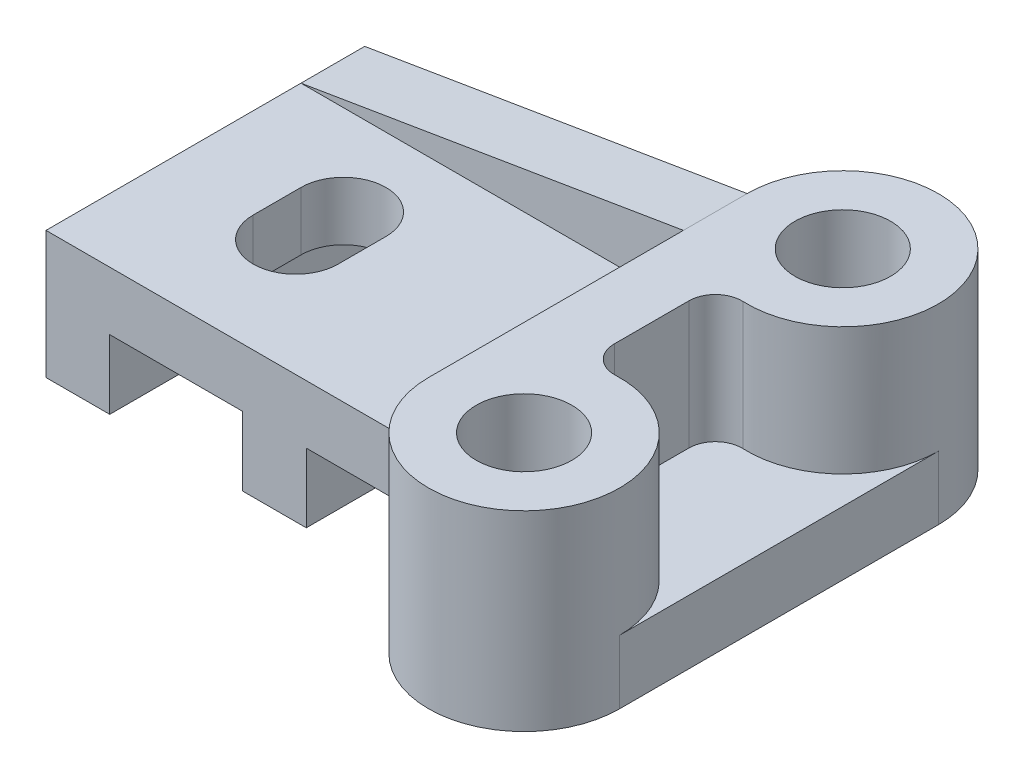
ISO-10303-21;
HEADER;
FILE_DESCRIPTION(('STEP AP214'),'2;1');
FILE_NAME('part.step','',(''),(''),'','','');
FILE_SCHEMA(('AUTOMOTIVE_DESIGN { 1 0 10303 214 1 1 1 1 }'));
ENDSEC;
DATA;
#1=APPLICATION_CONTEXT('core data for automotive mechanical design processes');
#2=APPLICATION_PROTOCOL_DEFINITION('international standard','automotive_design',2000,#1);
#3=PRODUCT_CONTEXT('',#1,'mechanical');
#4=PRODUCT('Part','Part','',(#3));
#5=PRODUCT_RELATED_PRODUCT_CATEGORY('part','',(#4));
#6=PRODUCT_DEFINITION_FORMATION('','',#4);
#7=PRODUCT_DEFINITION_CONTEXT('part definition',#1,'design');
#8=PRODUCT_DEFINITION('design','',#6,#7);
#9=PRODUCT_DEFINITION_SHAPE('','',#8);
#10=(LENGTH_UNIT() NAMED_UNIT(*) SI_UNIT(.MILLI.,.METRE.));
#11=(NAMED_UNIT(*) PLANE_ANGLE_UNIT() SI_UNIT($,.RADIAN.));
#12=(NAMED_UNIT(*) SI_UNIT($,.STERADIAN.) SOLID_ANGLE_UNIT());
#13=UNCERTAINTY_MEASURE_WITH_UNIT(LENGTH_MEASURE(1.E-05),#10,'distance_accuracy_value','');
#14=(GEOMETRIC_REPRESENTATION_CONTEXT(3) GLOBAL_UNCERTAINTY_ASSIGNED_CONTEXT((#13)) GLOBAL_UNIT_ASSIGNED_CONTEXT((#10,
#11,#12)) REPRESENTATION_CONTEXT('',''));
#15=CARTESIAN_POINT('',(0.,0.,0.));
#16=DIRECTION('',(0.,0.,1.));
#17=DIRECTION('',(1.,0.,0.));
#18=AXIS2_PLACEMENT_3D('',#15,#16,#17);
#19=CARTESIAN_POINT('',(0.,24.,30.));
#20=DIRECTION('',(0.,-1.,0.));
#21=DIRECTION('',(0.,0.,-1.));
#22=AXIS2_PLACEMENT_3D('',#19,#20,#21);
#23=PLANE('',#22);
#24=DIRECTION('',(0.,0.,1.));
#25=VECTOR('',#24,1.);
#26=CARTESIAN_POINT('',(17.,24.,-0.999999999999998));
#27=LINE('',#26,#25);
#28=CARTESIAN_POINT('',(17.,24.,-0.999999999999997));
#29=VERTEX_POINT('',#28);
#30=CARTESIAN_POINT('',(17.,24.,8.));
#31=VERTEX_POINT('',#30);
#32=EDGE_CURVE('E203',#29,#31,#27,.T.);
#33=ORIENTED_EDGE('',*,*,#32,.F.);
#34=CARTESIAN_POINT('',(25.,24.,-0.999999999999999));
#35=DIRECTION('',(0.,1.,0.));
#36=DIRECTION('',(0.,0.,1.));
#37=AXIS2_PLACEMENT_3D('',#34,#35,#36);
#38=CIRCLE('',#37,8.);
#39=CARTESIAN_POINT('',(33.,24.,-1.));
#40=VERTEX_POINT('',#39);
#41=EDGE_CURVE('E51',#40,#29,#38,.T.);
#42=ORIENTED_EDGE('',*,*,#41,.F.);
#43=DIRECTION('',(0.,0.,-1.));
#44=VECTOR('',#43,1.);
#45=CARTESIAN_POINT('',(33.,24.,-1.));
#46=LINE('',#45,#44);
#47=CARTESIAN_POINT('',(33.,24.,8.));
#48=VERTEX_POINT('',#47);
#49=EDGE_CURVE('E209',#48,#40,#46,.T.);
#50=ORIENTED_EDGE('',*,*,#49,.F.);
#51=CARTESIAN_POINT('',(25.,24.,8.));
#52=DIRECTION('',(0.,1.,0.));
#53=DIRECTION('',(0.,0.,1.));
#54=AXIS2_PLACEMENT_3D('',#51,#52,#53);
#55=CIRCLE('',#54,8.);
#56=EDGE_CURVE('E194',#31,#48,#55,.T.);
#57=ORIENTED_EDGE('',*,*,#56,.F.);
#58=EDGE_LOOP('',(#33,#42,#50,#57));
#59=FACE_BOUND('',#58,.T.);
#60=DIRECTION('',(1.,0.,0.));
#61=VECTOR('',#60,1.);
#62=CARTESIAN_POINT('',(0.,24.,-18.));
#63=LINE('',#62,#61);
#64=CARTESIAN_POINT('',(0.,24.,-18.));
#65=VERTEX_POINT('',#64);
#66=CARTESIAN_POINT('',(72.,24.,-18.));
#67=VERTEX_POINT('',#66);
#68=EDGE_CURVE('E226',#65,#67,#63,.T.);
#69=ORIENTED_EDGE('',*,*,#68,.F.);
#70=DIRECTION('',(0.,0.,-1.));
#71=VECTOR('',#70,1.);
#72=CARTESIAN_POINT('',(0.,24.,30.));
#73=LINE('',#72,#71);
#74=CARTESIAN_POINT('',(0.,24.,30.));
#75=VERTEX_POINT('',#74);
#76=EDGE_CURVE('E342',#75,#65,#73,.T.);
#77=ORIENTED_EDGE('',*,*,#76,.F.);
#78=DIRECTION('',(-1.,0.,0.));
#79=VECTOR('',#78,1.);
#80=CARTESIAN_POINT('',(0.,24.,30.));
#81=LINE('',#80,#79);
#82=CARTESIAN_POINT('',(72.,24.,30.));
#83=VERTEX_POINT('',#82);
#84=EDGE_CURVE('E312',#83,#75,#81,.T.);
#85=ORIENTED_EDGE('',*,*,#84,.F.);
#86=DIRECTION('',(0.,0.,-1.));
#87=VECTOR('',#86,1.);
#88=CARTESIAN_POINT('',(72.,24.,30.));
#89=LINE('',#88,#87);
#90=EDGE_CURVE('E345',#83,#67,#89,.T.);
#91=ORIENTED_EDGE('',*,*,#90,.T.);
#92=EDGE_LOOP('',(#69,#77,#85,#91));
#93=FACE_BOUND('',#92,.T.);
#94=ADVANCED_FACE('F36',(#59,#93),#23,.F.);
#95=CARTESIAN_POINT('',(72.,0.,-30.));
#96=DIRECTION('',(-1.,0.,0.));
#97=DIRECTION('',(0.,0.,1.));
#98=AXIS2_PLACEMENT_3D('',#95,#96,#97);
#99=PLANE('',#98);
#100=DIRECTION('',(0.,0.,1.));
#101=VECTOR('',#100,1.);
#102=CARTESIAN_POINT('',(72.,36.,-30.));
#103=LINE('',#102,#101);
#104=CARTESIAN_POINT('',(72.,36.,-18.));
#105=VERTEX_POINT('',#104);
#106=CARTESIAN_POINT('',(72.,36.,30.));
#107=VERTEX_POINT('',#106);
#108=EDGE_CURVE('E263',#105,#107,#103,.T.);
#109=ORIENTED_EDGE('',*,*,#108,.F.);
#110=DIRECTION('',(0.,-1.,0.));
#111=VECTOR('',#110,1.);
#112=CARTESIAN_POINT('',(72.,0.,-18.));
#113=LINE('',#112,#111);
#114=EDGE_CURVE('E221',#105,#67,#113,.T.);
#115=ORIENTED_EDGE('',*,*,#114,.T.);
#116=ORIENTED_EDGE('',*,*,#90,.F.);
#117=DIRECTION('',(0.,1.,0.));
#118=VECTOR('',#117,1.);
#119=CARTESIAN_POINT('',(72.,0.,30.));
#120=LINE('',#119,#118);
#121=EDGE_CURVE('E291',#83,#107,#120,.T.);
#122=ORIENTED_EDGE('',*,*,#121,.T.);
#123=EDGE_LOOP('',(#109,#115,#116,#122));
#124=FACE_BOUND('',#123,.T.);
#125=ADVANCED_FACE('F399',(#124),#99,.T.);
#126=CARTESIAN_POINT('',(90.,0.,-30.));
#127=DIRECTION('',(0.,1.,0.));
#128=DIRECTION('',(0.,0.,1.));
#129=AXIS2_PLACEMENT_3D('',#126,#127,#128);
#130=CYLINDRICAL_SURFACE('',#129,18.);
#131=DIRECTION('',(0.,1.,0.));
#132=VECTOR('',#131,1.);
#133=CARTESIAN_POINT('',(72.,13.,-30.));
#134=LINE('',#133,#132);
#135=CARTESIAN_POINT('',(72.,13.,-30.));
#136=VERTEX_POINT('',#135);
#137=CARTESIAN_POINT('',(72.,36.,-30.));
#138=VERTEX_POINT('',#137);
#139=EDGE_CURVE('E337',#136,#138,#134,.T.);
#140=ORIENTED_EDGE('',*,*,#139,.T.);
#141=CARTESIAN_POINT('',(90.,36.,-30.));
#142=DIRECTION('',(0.,1.,0.));
#143=DIRECTION('',(0.,0.,1.));
#144=AXIS2_PLACEMENT_3D('',#141,#142,#143);
#145=CIRCLE('',#144,18.);
#146=CARTESIAN_POINT('',(89.2173913043478,36.,-12.0170212804027));
#147=VERTEX_POINT('',#146);
#148=EDGE_CURVE('E260',#147,#138,#145,.T.);
#149=ORIENTED_EDGE('',*,*,#148,.F.);
#150=DIRECTION('',(0.,1.,0.));
#151=VECTOR('',#150,1.);
#152=CARTESIAN_POINT('',(89.2173913043478,0.,-12.0170212804027));
#153=LINE('',#152,#151);
#154=CARTESIAN_POINT('',(89.2173913043478,12.,-12.0170212804027));
#155=VERTEX_POINT('',#154);
#156=EDGE_CURVE('E369',#147,#155,#153,.F.);
#157=ORIENTED_EDGE('',*,*,#156,.T.);
#158=CARTESIAN_POINT('',(90.,12.,-30.));
#159=DIRECTION('',(0.,1.,0.));
#160=DIRECTION('',(0.,0.,-1.));
#161=AXIS2_PLACEMENT_3D('',#158,#159,#160);
#162=CIRCLE('',#161,18.);
#163=CARTESIAN_POINT('',(108.,12.,-30.));
#164=VERTEX_POINT('',#163);
#165=EDGE_CURVE('E243',#155,#164,#162,.T.);
#166=ORIENTED_EDGE('',*,*,#165,.T.);
#167=DIRECTION('',(0.,-1.,0.));
#168=VECTOR('',#167,1.);
#169=CARTESIAN_POINT('',(108.,12.,-30.));
#170=LINE('',#169,#168);
#171=CARTESIAN_POINT('',(108.,0.,-30.));
#172=VERTEX_POINT('',#171);
#173=EDGE_CURVE('E247',#164,#172,#170,.T.);
#174=ORIENTED_EDGE('',*,*,#173,.T.);
#175=CARTESIAN_POINT('',(90.,0.,-30.));
#176=DIRECTION('',(0.,1.,0.));
#177=DIRECTION('',(0.,0.,1.));
#178=AXIS2_PLACEMENT_3D('',#175,#176,#177);
#179=CIRCLE('',#178,18.);
#180=CARTESIAN_POINT('',(72.,0.,-30.));
#181=VERTEX_POINT('',#180);
#182=EDGE_CURVE('E279',#172,#181,#179,.T.);
#183=ORIENTED_EDGE('',*,*,#182,.T.);
#184=DIRECTION('',(0.,1.,0.));
#185=VECTOR('',#184,1.);
#186=CARTESIAN_POINT('',(72.,0.,-30.));
#187=LINE('',#186,#185);
#188=EDGE_CURVE('E286',#181,#136,#187,.T.);
#189=ORIENTED_EDGE('',*,*,#188,.T.);
#190=EDGE_LOOP('',(#140,#149,#157,#166,#174,#183,#189));
#191=FACE_BOUND('',#190,.T.);
#192=ADVANCED_FACE('F404',(#191),#130,.T.);
#193=CARTESIAN_POINT('',(84.,0.,-13.0294372515229));
#194=DIRECTION('',(1.,0.,0.));
#195=DIRECTION('',(0.,0.,-1.));
#196=AXIS2_PLACEMENT_3D('',#193,#194,#195);
#197=PLANE('',#196);
#198=DIRECTION('',(0.,-1.,0.));
#199=VECTOR('',#198,1.);
#200=CARTESIAN_POINT('',(84.,0.,7.02174941384788));
#201=LINE('',#200,#199);
#202=CARTESIAN_POINT('',(84.,36.,7.02174941384788));
#203=VERTEX_POINT('',#202);
#204=CARTESIAN_POINT('',(84.,12.,7.02174941384788));
#205=VERTEX_POINT('',#204);
#206=EDGE_CURVE('E366',#203,#205,#201,.T.);
#207=ORIENTED_EDGE('',*,*,#206,.T.);
#208=DIRECTION('',(0.,0.,-1.));
#209=VECTOR('',#208,1.);
#210=CARTESIAN_POINT('',(84.,12.,7.02174941384788));
#211=LINE('',#210,#209);
#212=CARTESIAN_POINT('',(84.,12.,-7.02174941384788));
#213=VERTEX_POINT('',#212);
#214=EDGE_CURVE('E237',#205,#213,#211,.T.);
#215=ORIENTED_EDGE('',*,*,#214,.T.);
#216=DIRECTION('',(0.,-1.,0.));
#217=VECTOR('',#216,1.);
#218=CARTESIAN_POINT('',(84.,36.,-7.02174941384788));
#219=LINE('',#218,#217);
#220=CARTESIAN_POINT('',(84.,36.,-7.02174941384788));
#221=VERTEX_POINT('',#220);
#222=EDGE_CURVE('E364',#213,#221,#219,.F.);
#223=ORIENTED_EDGE('',*,*,#222,.T.);
#224=DIRECTION('',(0.,0.,-1.));
#225=VECTOR('',#224,1.);
#226=CARTESIAN_POINT('',(84.,36.,-13.0294372515229));
#227=LINE('',#226,#225);
#228=EDGE_CURVE('E270',#203,#221,#227,.T.);
#229=ORIENTED_EDGE('',*,*,#228,.F.);
#230=EDGE_LOOP('',(#207,#215,#223,#229));
#231=FACE_BOUND('',#230,.T.);
#232=ADVANCED_FACE('F439',(#231),#197,.T.);
#233=CARTESIAN_POINT('',(89.,0.,7.02174941384788));
#234=DIRECTION('',(0.,1.,0.));
#235=DIRECTION('',(0.,0.,1.));
#236=AXIS2_PLACEMENT_3D('',#233,#234,#235);
#237=CYLINDRICAL_SURFACE('',#236,5.);
#238=CARTESIAN_POINT('',(89.,12.,7.02174941384788));
#239=DIRECTION('',(0.,-1.,0.));
#240=DIRECTION('',(0.,0.,-1.));
#241=AXIS2_PLACEMENT_3D('',#238,#239,#240);
#242=CIRCLE('',#241,5.);
#243=CARTESIAN_POINT('',(89.2173913043478,12.,12.0170212804027));
#244=VERTEX_POINT('',#243);
#245=EDGE_CURVE('E234',#244,#205,#242,.T.);
#246=ORIENTED_EDGE('',*,*,#245,.T.);
#247=ORIENTED_EDGE('',*,*,#206,.F.);
#248=CARTESIAN_POINT('',(89.,36.,7.02174941384788));
#249=DIRECTION('',(0.,1.,0.));
#250=DIRECTION('',(0.,0.,1.));
#251=AXIS2_PLACEMENT_3D('',#248,#249,#250);
#252=CIRCLE('',#251,5.);
#253=CARTESIAN_POINT('',(89.2173913043478,36.,12.0170212804027));
#254=VERTEX_POINT('',#253);
#255=EDGE_CURVE('E372',#254,#203,#252,.F.);
#256=ORIENTED_EDGE('',*,*,#255,.F.);
#257=DIRECTION('',(0.,1.,0.));
#258=VECTOR('',#257,1.);
#259=CARTESIAN_POINT('',(89.2173913043478,0.,12.0170212804027));
#260=LINE('',#259,#258);
#261=EDGE_CURVE('E362',#244,#254,#260,.T.);
#262=ORIENTED_EDGE('',*,*,#261,.F.);
#263=EDGE_LOOP('',(#246,#247,#256,#262));
#264=FACE_BOUND('',#263,.T.);
#265=ADVANCED_FACE('F437',(#264),#237,.F.);
#266=CARTESIAN_POINT('',(89.,0.,-7.02174941384788));
#267=DIRECTION('',(0.,1.,0.));
#268=DIRECTION('',(0.,0.,1.));
#269=AXIS2_PLACEMENT_3D('',#266,#267,#268);
#270=CYLINDRICAL_SURFACE('',#269,5.);
#271=CARTESIAN_POINT('',(89.,12.,-7.02174941384788));
#272=DIRECTION('',(0.,-1.,0.));
#273=DIRECTION('',(0.,0.,-1.));
#274=AXIS2_PLACEMENT_3D('',#271,#272,#273);
#275=CIRCLE('',#274,5.);
#276=EDGE_CURVE('E240',#213,#155,#275,.T.);
#277=ORIENTED_EDGE('',*,*,#276,.T.);
#278=ORIENTED_EDGE('',*,*,#156,.F.);
#279=CARTESIAN_POINT('',(89.,36.,-7.02174941384788));
#280=DIRECTION('',(0.,1.,0.));
#281=DIRECTION('',(0.,0.,1.));
#282=AXIS2_PLACEMENT_3D('',#279,#280,#281);
#283=CIRCLE('',#282,5.);
#284=EDGE_CURVE('E374',#221,#147,#283,.F.);
#285=ORIENTED_EDGE('',*,*,#284,.F.);
#286=ORIENTED_EDGE('',*,*,#222,.F.);
#287=EDGE_LOOP('',(#277,#278,#285,#286));
#288=FACE_BOUND('',#287,.T.);
#289=ADVANCED_FACE('F38',(#288),#270,.F.);
#290=CARTESIAN_POINT('',(0.,0.,30.));
#291=DIRECTION('',(0.,1.,0.));
#292=DIRECTION('',(0.,0.,1.));
#293=AXIS2_PLACEMENT_3D('',#290,#291,#292);
#294=PLANE('',#293);
#295=DIRECTION('',(1.,0.,0.));
#296=VECTOR('',#295,1.);
#297=CARTESIAN_POINT('',(0.,0.,-30.));
#298=LINE('',#297,#296);
#299=CARTESIAN_POINT('',(0.,0.,-30.));
#300=VERTEX_POINT('',#299);
#301=CARTESIAN_POINT('',(12.,0.,-30.));
#302=VERTEX_POINT('',#301);
#303=EDGE_CURVE('E290',#300,#302,#298,.T.);
#304=ORIENTED_EDGE('',*,*,#303,.T.);
#305=DIRECTION('',(0.,0.,-1.));
#306=VECTOR('',#305,1.);
#307=CARTESIAN_POINT('',(12.,0.,30.));
#308=LINE('',#307,#306);
#309=CARTESIAN_POINT('',(12.,0.,30.));
#310=VERTEX_POINT('',#309);
#311=EDGE_CURVE('E360',#310,#302,#308,.T.);
#312=ORIENTED_EDGE('',*,*,#311,.F.);
#313=DIRECTION('',(1.,0.,0.));
#314=VECTOR('',#313,1.);
#315=CARTESIAN_POINT('',(0.,0.,30.));
#316=LINE('',#315,#314);
#317=CARTESIAN_POINT('',(0.,0.,30.));
#318=VERTEX_POINT('',#317);
#319=EDGE_CURVE('E294',#318,#310,#316,.T.);
#320=ORIENTED_EDGE('',*,*,#319,.F.);
#321=DIRECTION('',(0.,0.,-1.));
#322=VECTOR('',#321,1.);
#323=CARTESIAN_POINT('',(0.,0.,30.));
#324=LINE('',#323,#322);
#325=EDGE_CURVE('E316',#318,#300,#324,.T.);
#326=ORIENTED_EDGE('',*,*,#325,.T.);
#327=EDGE_LOOP('',(#304,#312,#320,#326));
#328=FACE_BOUND('',#327,.T.);
#329=ADVANCED_FACE('F433',(#328),#294,.F.);
#330=CARTESIAN_POINT('',(12.,0.,30.));
#331=DIRECTION('',(-1.,0.,0.));
#332=DIRECTION('',(0.,0.,1.));
#333=AXIS2_PLACEMENT_3D('',#330,#331,#332);
#334=PLANE('',#333);
#335=DIRECTION('',(0.,1.,0.));
#336=VECTOR('',#335,1.);
#337=CARTESIAN_POINT('',(12.,0.,-30.));
#338=LINE('',#337,#336);
#339=CARTESIAN_POINT('',(12.,13.,-30.));
#340=VERTEX_POINT('',#339);
#341=EDGE_CURVE('E319',#302,#340,#338,.T.);
#342=ORIENTED_EDGE('',*,*,#341,.T.);
#343=DIRECTION('',(0.,0.,-1.));
#344=VECTOR('',#343,1.);
#345=CARTESIAN_POINT('',(12.,13.,30.));
#346=LINE('',#345,#344);
#347=CARTESIAN_POINT('',(12.,13.,30.));
#348=VERTEX_POINT('',#347);
#349=EDGE_CURVE('E358',#348,#340,#346,.T.);
#350=ORIENTED_EDGE('',*,*,#349,.F.);
#351=DIRECTION('',(0.,1.,0.));
#352=VECTOR('',#351,1.);
#353=CARTESIAN_POINT('',(12.,0.,30.));
#354=LINE('',#353,#352);
#355=EDGE_CURVE('E297',#310,#348,#354,.T.);
#356=ORIENTED_EDGE('',*,*,#355,.F.);
#357=ORIENTED_EDGE('',*,*,#311,.T.);
#358=EDGE_LOOP('',(#342,#350,#356,#357));
#359=FACE_BOUND('',#358,.T.);
#360=ADVANCED_FACE('F430',(#359),#334,.F.);
#361=CARTESIAN_POINT('',(12.,13.,30.));
#362=DIRECTION('',(0.,1.,0.));
#363=DIRECTION('',(0.,0.,1.));
#364=AXIS2_PLACEMENT_3D('',#361,#362,#363);
#365=PLANE('',#364);
#366=DIRECTION('',(0.,0.,-1.));
#367=VECTOR('',#366,1.);
#368=CARTESIAN_POINT('',(33.,13.,30.));
#369=LINE('',#368,#367);
#370=CARTESIAN_POINT('',(33.,13.,8.));
#371=VERTEX_POINT('',#370);
#372=CARTESIAN_POINT('',(33.,13.,-1.));
#373=VERTEX_POINT('',#372);
#374=EDGE_CURVE('E44',#371,#373,#369,.T.);
#375=ORIENTED_EDGE('',*,*,#374,.T.);
#376=CARTESIAN_POINT('',(25.,13.,-0.999999999999999));
#377=DIRECTION('',(0.,1.,0.));
#378=DIRECTION('',(0.,0.,1.));
#379=AXIS2_PLACEMENT_3D('',#376,#377,#378);
#380=CIRCLE('',#379,8.);
#381=CARTESIAN_POINT('',(17.,13.,-0.999999999999998));
#382=VERTEX_POINT('',#381);
#383=EDGE_CURVE('E11',#373,#382,#380,.T.);
#384=ORIENTED_EDGE('',*,*,#383,.T.);
#385=DIRECTION('',(0.,0.,1.));
#386=VECTOR('',#385,1.);
#387=CARTESIAN_POINT('',(17.,13.,30.));
#388=LINE('',#387,#386);
#389=CARTESIAN_POINT('',(17.,13.,8.));
#390=VERTEX_POINT('',#389);
#391=EDGE_CURVE('E376',#382,#390,#388,.T.);
#392=ORIENTED_EDGE('',*,*,#391,.T.);
#393=CARTESIAN_POINT('',(25.,13.,8.));
#394=DIRECTION('',(0.,1.,0.));
#395=DIRECTION('',(0.,0.,1.));
#396=AXIS2_PLACEMENT_3D('',#393,#394,#395);
#397=CIRCLE('',#396,8.);
#398=EDGE_CURVE('E197',#390,#371,#397,.T.);
#399=ORIENTED_EDGE('',*,*,#398,.T.);
#400=EDGE_LOOP('',(#375,#384,#392,#399));
#401=FACE_BOUND('',#400,.T.);
#402=DIRECTION('',(1.,0.,0.));
#403=VECTOR('',#402,1.);
#404=CARTESIAN_POINT('',(12.,13.,-30.));
#405=LINE('',#404,#403);
#406=CARTESIAN_POINT('',(37.,13.,-30.));
#407=VERTEX_POINT('',#406);
#408=EDGE_CURVE('E322',#340,#407,#405,.T.);
#409=ORIENTED_EDGE('',*,*,#408,.T.);
#410=DIRECTION('',(0.,0.,-1.));
#411=VECTOR('',#410,1.);
#412=CARTESIAN_POINT('',(37.,13.,30.));
#413=LINE('',#412,#411);
#414=CARTESIAN_POINT('',(37.,13.,30.));
#415=VERTEX_POINT('',#414);
#416=EDGE_CURVE('E356',#415,#407,#413,.T.);
#417=ORIENTED_EDGE('',*,*,#416,.F.);
#418=DIRECTION('',(1.,0.,0.));
#419=VECTOR('',#418,1.);
#420=CARTESIAN_POINT('',(12.,13.,30.));
#421=LINE('',#420,#419);
#422=EDGE_CURVE('E300',#348,#415,#421,.T.);
#423=ORIENTED_EDGE('',*,*,#422,.F.);
#424=ORIENTED_EDGE('',*,*,#349,.T.);
#425=EDGE_LOOP('',(#409,#417,#423,#424));
#426=FACE_BOUND('',#425,.T.);
#427=ADVANCED_FACE('F380',(#401,#426),#365,.F.);
#428=CARTESIAN_POINT('',(37.,13.,30.));
#429=DIRECTION('',(1.,0.,0.));
#430=DIRECTION('',(0.,0.,-1.));
#431=AXIS2_PLACEMENT_3D('',#428,#429,#430);
#432=PLANE('',#431);
#433=DIRECTION('',(0.,-1.,0.));
#434=VECTOR('',#433,1.);
#435=CARTESIAN_POINT('',(37.,13.,-30.));
#436=LINE('',#435,#434);
#437=CARTESIAN_POINT('',(37.,0.,-30.));
#438=VERTEX_POINT('',#437);
#439=EDGE_CURVE('E325',#407,#438,#436,.T.);
#440=ORIENTED_EDGE('',*,*,#439,.T.);
#441=DIRECTION('',(0.,0.,-1.));
#442=VECTOR('',#441,1.);
#443=CARTESIAN_POINT('',(37.,0.,30.));
#444=LINE('',#443,#442);
#445=CARTESIAN_POINT('',(37.,0.,30.));
#446=VERTEX_POINT('',#445);
#447=EDGE_CURVE('E354',#446,#438,#444,.T.);
#448=ORIENTED_EDGE('',*,*,#447,.F.);
#449=DIRECTION('',(0.,-1.,0.));
#450=VECTOR('',#449,1.);
#451=CARTESIAN_POINT('',(37.,13.,30.));
#452=LINE('',#451,#450);
#453=EDGE_CURVE('E302',#415,#446,#452,.T.);
#454=ORIENTED_EDGE('',*,*,#453,.F.);
#455=ORIENTED_EDGE('',*,*,#416,.T.);
#456=EDGE_LOOP('',(#440,#448,#454,#455));
#457=FACE_BOUND('',#456,.T.);
#458=ADVANCED_FACE('F423',(#457),#432,.F.);
#459=CARTESIAN_POINT('',(37.,0.,30.));
#460=DIRECTION('',(0.,1.,0.));
#461=DIRECTION('',(0.,0.,1.));
#462=AXIS2_PLACEMENT_3D('',#459,#460,#461);
#463=PLANE('',#462);
#464=DIRECTION('',(1.,0.,0.));
#465=VECTOR('',#464,1.);
#466=CARTESIAN_POINT('',(37.,0.,-30.));
#467=LINE('',#466,#465);
#468=CARTESIAN_POINT('',(49.,0.,-30.));
#469=VERTEX_POINT('',#468);
#470=EDGE_CURVE('E328',#438,#469,#467,.T.);
#471=ORIENTED_EDGE('',*,*,#470,.T.);
#472=DIRECTION('',(0.,0.,-1.));
#473=VECTOR('',#472,1.);
#474=CARTESIAN_POINT('',(49.,0.,30.));
#475=LINE('',#474,#473);
#476=CARTESIAN_POINT('',(49.,0.,30.));
#477=VERTEX_POINT('',#476);
#478=EDGE_CURVE('E352',#477,#469,#475,.T.);
#479=ORIENTED_EDGE('',*,*,#478,.F.);
#480=DIRECTION('',(1.,0.,0.));
#481=VECTOR('',#480,1.);
#482=CARTESIAN_POINT('',(37.,0.,30.));
#483=LINE('',#482,#481);
#484=EDGE_CURVE('E304',#446,#477,#483,.T.);
#485=ORIENTED_EDGE('',*,*,#484,.F.);
#486=ORIENTED_EDGE('',*,*,#447,.T.);
#487=EDGE_LOOP('',(#471,#479,#485,#486));
#488=FACE_BOUND('',#487,.T.);
#489=ADVANCED_FACE('F419',(#488),#463,.F.);
#490=CARTESIAN_POINT('',(49.,0.,30.));
#491=DIRECTION('',(-1.,0.,0.));
#492=DIRECTION('',(0.,0.,1.));
#493=AXIS2_PLACEMENT_3D('',#490,#491,#492);
#494=PLANE('',#493);
#495=DIRECTION('',(0.,1.,0.));
#496=VECTOR('',#495,1.);
#497=CARTESIAN_POINT('',(49.,0.,-30.));
#498=LINE('',#497,#496);
#499=CARTESIAN_POINT('',(49.,13.,-30.));
#500=VERTEX_POINT('',#499);
#501=EDGE_CURVE('E331',#469,#500,#498,.T.);
#502=ORIENTED_EDGE('',*,*,#501,.T.);
#503=DIRECTION('',(0.,0.,-1.));
#504=VECTOR('',#503,1.);
#505=CARTESIAN_POINT('',(49.,13.,30.));
#506=LINE('',#505,#504);
#507=CARTESIAN_POINT('',(49.,13.,30.));
#508=VERTEX_POINT('',#507);
#509=EDGE_CURVE('E350',#508,#500,#506,.T.);
#510=ORIENTED_EDGE('',*,*,#509,.F.);
#511=DIRECTION('',(0.,1.,0.));
#512=VECTOR('',#511,1.);
#513=CARTESIAN_POINT('',(49.,0.,30.));
#514=LINE('',#513,#512);
#515=EDGE_CURVE('E306',#477,#508,#514,.T.);
#516=ORIENTED_EDGE('',*,*,#515,.F.);
#517=ORIENTED_EDGE('',*,*,#478,.T.);
#518=EDGE_LOOP('',(#502,#510,#516,#517));
#519=FACE_BOUND('',#518,.T.);
#520=ADVANCED_FACE('F415',(#519),#494,.F.);
#521=CARTESIAN_POINT('',(49.,13.,30.));
#522=DIRECTION('',(0.,1.,0.));
#523=DIRECTION('',(0.,0.,1.));
#524=AXIS2_PLACEMENT_3D('',#521,#522,#523);
#525=PLANE('',#524);
#526=DIRECTION('',(1.,0.,0.));
#527=VECTOR('',#526,1.);
#528=CARTESIAN_POINT('',(49.,13.,-30.));
#529=LINE('',#528,#527);
#530=EDGE_CURVE('E334',#500,#136,#529,.T.);
#531=ORIENTED_EDGE('',*,*,#530,.T.);
#532=DIRECTION('',(0.,0.,-1.));
#533=VECTOR('',#532,1.);
#534=CARTESIAN_POINT('',(72.,13.,30.));
#535=LINE('',#534,#533);
#536=CARTESIAN_POINT('',(72.,13.,30.));
#537=VERTEX_POINT('',#536);
#538=EDGE_CURVE('E348',#537,#136,#535,.T.);
#539=ORIENTED_EDGE('',*,*,#538,.F.);
#540=DIRECTION('',(1.,0.,0.));
#541=VECTOR('',#540,1.);
#542=CARTESIAN_POINT('',(49.,13.,30.));
#543=LINE('',#542,#541);
#544=EDGE_CURVE('E308',#508,#537,#543,.T.);
#545=ORIENTED_EDGE('',*,*,#544,.F.);
#546=ORIENTED_EDGE('',*,*,#509,.T.);
#547=EDGE_LOOP('',(#531,#539,#545,#546));
#548=FACE_BOUND('',#547,.T.);
#549=ADVANCED_FACE('F412',(#548),#525,.F.);
#550=CARTESIAN_POINT('',(0.,0.,30.));
#551=DIRECTION('',(1.,0.,0.));
#552=DIRECTION('',(0.,0.,-1.));
#553=AXIS2_PLACEMENT_3D('',#550,#551,#552);
#554=PLANE('',#553);
#555=DIRECTION('',(0.,-1.,0.));
#556=VECTOR('',#555,1.);
#557=CARTESIAN_POINT('',(0.,0.,-30.));
#558=LINE('',#557,#556);
#559=CARTESIAN_POINT('',(0.,24.,-30.));
#560=VERTEX_POINT('',#559);
#561=EDGE_CURVE('E298',#560,#300,#558,.T.);
#562=ORIENTED_EDGE('',*,*,#561,.T.);
#563=ORIENTED_EDGE('',*,*,#325,.F.);
#564=DIRECTION('',(0.,-1.,0.));
#565=VECTOR('',#564,1.);
#566=CARTESIAN_POINT('',(0.,0.,30.));
#567=LINE('',#566,#565);
#568=EDGE_CURVE('E314',#75,#318,#567,.T.);
#569=ORIENTED_EDGE('',*,*,#568,.F.);
#570=ORIENTED_EDGE('',*,*,#76,.T.);
#571=DIRECTION('',(0.,0.,-1.));
#572=VECTOR('',#571,1.);
#573=CARTESIAN_POINT('',(0.,24.,30.));
#574=LINE('',#573,#572);
#575=EDGE_CURVE('E228',#560,#65,#574,.F.);
#576=ORIENTED_EDGE('',*,*,#575,.F.);
#577=EDGE_LOOP('',(#562,#563,#569,#570,#576));
#578=FACE_BOUND('',#577,.T.);
#579=ADVANCED_FACE('F410',(#578),#554,.F.);
#580=CARTESIAN_POINT('',(0.,0.,30.));
#581=DIRECTION('',(0.,0.,1.));
#582=DIRECTION('',(1.,0.,0.));
#583=AXIS2_PLACEMENT_3D('',#580,#581,#582);
#584=PLANE('',#583);
#585=ORIENTED_EDGE('',*,*,#319,.T.);
#586=ORIENTED_EDGE('',*,*,#355,.T.);
#587=ORIENTED_EDGE('',*,*,#422,.T.);
#588=ORIENTED_EDGE('',*,*,#453,.T.);
#589=ORIENTED_EDGE('',*,*,#484,.T.);
#590=ORIENTED_EDGE('',*,*,#515,.T.);
#591=ORIENTED_EDGE('',*,*,#544,.T.);
#592=DIRECTION('',(0.,1.,0.));
#593=VECTOR('',#592,1.);
#594=CARTESIAN_POINT('',(72.,13.,30.));
#595=LINE('',#594,#593);
#596=EDGE_CURVE('E310',#537,#83,#595,.T.);
#597=ORIENTED_EDGE('',*,*,#596,.T.);
#598=ORIENTED_EDGE('',*,*,#84,.T.);
#599=ORIENTED_EDGE('',*,*,#568,.T.);
#600=EDGE_LOOP('',(#585,#586,#587,#588,#589,#590,#591,#597,#598,#599));
#601=FACE_BOUND('',#600,.T.);
#602=ADVANCED_FACE('F485',(#601),#584,.T.);
#603=CARTESIAN_POINT('',(0.,0.,-30.));
#604=DIRECTION('',(0.,0.,1.));
#605=DIRECTION('',(1.,0.,0.));
#606=AXIS2_PLACEMENT_3D('',#603,#604,#605);
#607=PLANE('',#606);
#608=ORIENTED_EDGE('',*,*,#303,.F.);
#609=ORIENTED_EDGE('',*,*,#561,.F.);
#610=DIRECTION('',(-0.986393923832144,-0.164398987305357,0.));
#611=VECTOR('',#610,1.);
#612=CARTESIAN_POINT('',(72.,36.,-30.));
#613=LINE('',#612,#611);
#614=EDGE_CURVE('E219',#138,#560,#613,.T.);
#615=ORIENTED_EDGE('',*,*,#614,.F.);
#616=ORIENTED_EDGE('',*,*,#139,.F.);
#617=ORIENTED_EDGE('',*,*,#530,.F.);
#618=ORIENTED_EDGE('',*,*,#501,.F.);
#619=ORIENTED_EDGE('',*,*,#470,.F.);
#620=ORIENTED_EDGE('',*,*,#439,.F.);
#621=ORIENTED_EDGE('',*,*,#408,.F.);
#622=ORIENTED_EDGE('',*,*,#341,.F.);
#623=EDGE_LOOP('',(#608,#609,#615,#616,#617,#618,#619,#620,#621,#622));
#624=FACE_BOUND('',#623,.T.);
#625=ADVANCED_FACE('F504',(#624),#607,.F.);
#626=DIRECTION('',(0.,0.,1.));
#627=VECTOR('',#626,1.);
#628=CARTESIAN_POINT('',(72.,0.,-30.));
#629=LINE('',#628,#627);
#630=CARTESIAN_POINT('',(72.,0.,30.));
#631=VERTEX_POINT('',#630);
#632=EDGE_CURVE('E281',#181,#631,#629,.T.);
#633=ORIENTED_EDGE('',*,*,#632,.T.);
#634=EDGE_CURVE('E287',#631,#537,#120,.T.);
#635=ORIENTED_EDGE('',*,*,#634,.T.);
#636=ORIENTED_EDGE('',*,*,#538,.T.);
#637=ORIENTED_EDGE('',*,*,#188,.F.);
#638=EDGE_LOOP('',(#633,#635,#636,#637));
#639=FACE_BOUND('',#638,.T.);
#640=ADVANCED_FACE('F407',(#639),#99,.T.);
#641=CARTESIAN_POINT('',(90.,0.,30.));
#642=DIRECTION('',(0.,1.,0.));
#643=DIRECTION('',(0.,0.,1.));
#644=AXIS2_PLACEMENT_3D('',#641,#642,#643);
#645=CYLINDRICAL_SURFACE('',#644,18.);
#646=DIRECTION('',(0.,-1.,0.));
#647=VECTOR('',#646,1.);
#648=CARTESIAN_POINT('',(108.,12.,30.));
#649=LINE('',#648,#647);
#650=CARTESIAN_POINT('',(108.,12.,30.));
#651=VERTEX_POINT('',#650);
#652=CARTESIAN_POINT('',(108.,0.,30.));
#653=VERTEX_POINT('',#652);
#654=EDGE_CURVE('E249',#651,#653,#649,.T.);
#655=ORIENTED_EDGE('',*,*,#654,.F.);
#656=CARTESIAN_POINT('',(90.,12.,30.));
#657=DIRECTION('',(0.,1.,0.));
#658=DIRECTION('',(0.,0.,-1.));
#659=AXIS2_PLACEMENT_3D('',#656,#657,#658);
#660=CIRCLE('',#659,18.);
#661=EDGE_CURVE('E231',#651,#244,#660,.T.);
#662=ORIENTED_EDGE('',*,*,#661,.T.);
#663=ORIENTED_EDGE('',*,*,#261,.T.);
#664=CARTESIAN_POINT('',(90.,36.,30.));
#665=DIRECTION('',(0.,1.,0.));
#666=DIRECTION('',(0.,0.,1.));
#667=AXIS2_PLACEMENT_3D('',#664,#665,#666);
#668=CIRCLE('',#667,18.);
#669=EDGE_CURVE('E267',#107,#254,#668,.T.);
#670=ORIENTED_EDGE('',*,*,#669,.F.);
#671=ORIENTED_EDGE('',*,*,#121,.F.);
#672=ORIENTED_EDGE('',*,*,#596,.F.);
#673=ORIENTED_EDGE('',*,*,#634,.F.);
#674=CARTESIAN_POINT('',(90.,0.,30.));
#675=DIRECTION('',(0.,1.,0.));
#676=DIRECTION('',(0.,0.,1.));
#677=AXIS2_PLACEMENT_3D('',#674,#675,#676);
#678=CIRCLE('',#677,18.);
#679=EDGE_CURVE('E283',#631,#653,#678,.T.);
#680=ORIENTED_EDGE('',*,*,#679,.T.);
#681=EDGE_LOOP('',(#655,#662,#663,#670,#671,#672,#673,#680));
#682=FACE_BOUND('',#681,.T.);
#683=ADVANCED_FACE('F466',(#682),#645,.T.);
#684=CARTESIAN_POINT('',(90.,0.,-30.));
#685=DIRECTION('',(0.,1.,0.));
#686=DIRECTION('',(0.,0.,1.));
#687=AXIS2_PLACEMENT_3D('',#684,#685,#686);
#688=PLANE('',#687);
#689=CARTESIAN_POINT('',(90.,0.,-30.));
#690=DIRECTION('',(0.,1.,0.));
#691=DIRECTION('',(0.,0.,1.));
#692=AXIS2_PLACEMENT_3D('',#689,#690,#691);
#693=CIRCLE('',#692,9.);
#694=CARTESIAN_POINT('',(90.,0.,-21.));
#695=VERTEX_POINT('',#694);
#696=EDGE_CURVE('E276',#695,#695,#693,.T.);
#697=ORIENTED_EDGE('',*,*,#696,.T.);
#698=EDGE_LOOP('',(#697));
#699=FACE_BOUND('',#698,.T.);
#700=ORIENTED_EDGE('',*,*,#182,.F.);
#701=DIRECTION('',(0.,0.,1.));
#702=VECTOR('',#701,1.);
#703=CARTESIAN_POINT('',(108.,0.,30.));
#704=LINE('',#703,#702);
#705=EDGE_CURVE('E230',#172,#653,#704,.T.);
#706=ORIENTED_EDGE('',*,*,#705,.T.);
#707=ORIENTED_EDGE('',*,*,#679,.F.);
#708=ORIENTED_EDGE('',*,*,#632,.F.);
#709=EDGE_LOOP('',(#700,#706,#707,#708));
#710=FACE_BOUND('',#709,.T.);
#711=CARTESIAN_POINT('',(90.,0.,30.));
#712=DIRECTION('',(0.,1.,0.));
#713=DIRECTION('',(0.,0.,1.));
#714=AXIS2_PLACEMENT_3D('',#711,#712,#713);
#715=CIRCLE('',#714,9.);
#716=CARTESIAN_POINT('',(90.,0.,39.));
#717=VERTEX_POINT('',#716);
#718=EDGE_CURVE('E273',#717,#717,#715,.T.);
#719=ORIENTED_EDGE('',*,*,#718,.T.);
#720=EDGE_LOOP('',(#719));
#721=FACE_BOUND('',#720,.T.);
#722=ADVANCED_FACE('F478',(#699,#710,#721),#688,.F.);
#723=CARTESIAN_POINT('',(90.,0.,-30.));
#724=DIRECTION('',(0.,1.,0.));
#725=DIRECTION('',(0.,0.,1.));
#726=AXIS2_PLACEMENT_3D('',#723,#724,#725);
#727=CYLINDRICAL_SURFACE('',#726,9.);
#728=ORIENTED_EDGE('',*,*,#696,.F.);
#729=EDGE_LOOP('',(#728));
#730=FACE_BOUND('',#729,.T.);
#731=CARTESIAN_POINT('',(90.,36.,-30.));
#732=DIRECTION('',(0.,1.,0.));
#733=DIRECTION('',(0.,0.,1.));
#734=AXIS2_PLACEMENT_3D('',#731,#732,#733);
#735=CIRCLE('',#734,9.);
#736=CARTESIAN_POINT('',(90.,36.,-21.));
#737=VERTEX_POINT('',#736);
#738=EDGE_CURVE('E257',#737,#737,#735,.T.);
#739=ORIENTED_EDGE('',*,*,#738,.T.);
#740=EDGE_LOOP('',(#739));
#741=FACE_BOUND('',#740,.T.);
#742=ADVANCED_FACE('F537',(#730,#741),#727,.F.);
#743=CARTESIAN_POINT('',(90.,0.,30.));
#744=DIRECTION('',(0.,1.,0.));
#745=DIRECTION('',(0.,0.,1.));
#746=AXIS2_PLACEMENT_3D('',#743,#744,#745);
#747=CYLINDRICAL_SURFACE('',#746,9.);
#748=ORIENTED_EDGE('',*,*,#718,.F.);
#749=EDGE_LOOP('',(#748));
#750=FACE_BOUND('',#749,.T.);
#751=CARTESIAN_POINT('',(90.,36.,30.));
#752=DIRECTION('',(0.,1.,0.));
#753=DIRECTION('',(0.,0.,1.));
#754=AXIS2_PLACEMENT_3D('',#751,#752,#753);
#755=CIRCLE('',#754,9.);
#756=CARTESIAN_POINT('',(90.,36.,39.));
#757=VERTEX_POINT('',#756);
#758=EDGE_CURVE('E252',#757,#757,#755,.T.);
#759=ORIENTED_EDGE('',*,*,#758,.T.);
#760=EDGE_LOOP('',(#759));
#761=FACE_BOUND('',#760,.T.);
#762=ADVANCED_FACE('F533',(#750,#761),#747,.F.);
#763=CARTESIAN_POINT('',(90.,36.,-30.));
#764=DIRECTION('',(0.,1.,0.));
#765=DIRECTION('',(0.,0.,1.));
#766=AXIS2_PLACEMENT_3D('',#763,#764,#765);
#767=PLANE('',#766);
#768=ORIENTED_EDGE('',*,*,#738,.F.);
#769=EDGE_LOOP('',(#768));
#770=FACE_BOUND('',#769,.T.);
#771=ORIENTED_EDGE('',*,*,#148,.T.);
#772=EDGE_CURVE('E264',#138,#105,#103,.T.);
#773=ORIENTED_EDGE('',*,*,#772,.T.);
#774=ORIENTED_EDGE('',*,*,#108,.T.);
#775=ORIENTED_EDGE('',*,*,#669,.T.);
#776=ORIENTED_EDGE('',*,*,#255,.T.);
#777=ORIENTED_EDGE('',*,*,#228,.T.);
#778=ORIENTED_EDGE('',*,*,#284,.T.);
#779=EDGE_LOOP('',(#771,#773,#774,#775,#776,#777,#778));
#780=FACE_BOUND('',#779,.T.);
#781=ORIENTED_EDGE('',*,*,#758,.F.);
#782=EDGE_LOOP('',(#781));
#783=FACE_BOUND('',#782,.T.);
#784=ADVANCED_FACE('F457',(#770,#780,#783),#767,.T.);
#785=CARTESIAN_POINT('',(108.,12.,30.));
#786=DIRECTION('',(1.,0.,0.));
#787=DIRECTION('',(0.,0.,-1.));
#788=AXIS2_PLACEMENT_3D('',#785,#786,#787);
#789=PLANE('',#788);
#790=DIRECTION('',(0.,0.,1.));
#791=VECTOR('',#790,1.);
#792=CARTESIAN_POINT('',(108.,12.,30.));
#793=LINE('',#792,#791);
#794=EDGE_CURVE('E245',#164,#651,#793,.T.);
#795=ORIENTED_EDGE('',*,*,#794,.T.);
#796=ORIENTED_EDGE('',*,*,#654,.T.);
#797=ORIENTED_EDGE('',*,*,#705,.F.);
#798=ORIENTED_EDGE('',*,*,#173,.F.);
#799=EDGE_LOOP('',(#795,#796,#797,#798));
#800=FACE_BOUND('',#799,.T.);
#801=ADVANCED_FACE('F472',(#800),#789,.T.);
#802=CARTESIAN_POINT('',(90.,12.,30.));
#803=DIRECTION('',(0.,-1.,0.));
#804=DIRECTION('',(0.,0.,-1.));
#805=AXIS2_PLACEMENT_3D('',#802,#803,#804);
#806=PLANE('',#805);
#807=ORIENTED_EDGE('',*,*,#794,.F.);
#808=ORIENTED_EDGE('',*,*,#165,.F.);
#809=ORIENTED_EDGE('',*,*,#276,.F.);
#810=ORIENTED_EDGE('',*,*,#214,.F.);
#811=ORIENTED_EDGE('',*,*,#245,.F.);
#812=ORIENTED_EDGE('',*,*,#661,.F.);
#813=EDGE_LOOP('',(#807,#808,#809,#810,#811,#812));
#814=FACE_BOUND('',#813,.T.);
#815=ADVANCED_FACE('F469',(#814),#806,.F.);
#816=CARTESIAN_POINT('',(72.,36.,-30.));
#817=DIRECTION('',(0.164398987305357,-0.986393923832144,0.));
#818=DIRECTION('',(-0.986393923832144,-0.164398987305357,0.));
#819=AXIS2_PLACEMENT_3D('',#816,#817,#818);
#820=PLANE('',#819);
#821=ORIENTED_EDGE('',*,*,#614,.T.);
#822=ORIENTED_EDGE('',*,*,#575,.T.);
#823=DIRECTION('',(-0.986393923832144,-0.164398987305357,0.));
#824=VECTOR('',#823,1.);
#825=CARTESIAN_POINT('',(72.,36.,-18.));
#826=LINE('',#825,#824);
#827=EDGE_CURVE('E216',#105,#65,#826,.T.);
#828=ORIENTED_EDGE('',*,*,#827,.F.);
#829=ORIENTED_EDGE('',*,*,#772,.F.);
#830=EDGE_LOOP('',(#821,#822,#828,#829));
#831=FACE_BOUND('',#830,.T.);
#832=ADVANCED_FACE('F394',(#831),#820,.F.);
#833=CARTESIAN_POINT('',(54.,18.,-18.));
#834=DIRECTION('',(0.,0.,-1.));
#835=DIRECTION('',(-1.,0.,0.));
#836=AXIS2_PLACEMENT_3D('',#833,#834,#835);
#837=PLANE('',#836);
#838=ORIENTED_EDGE('',*,*,#827,.T.);
#839=ORIENTED_EDGE('',*,*,#68,.T.);
#840=ORIENTED_EDGE('',*,*,#114,.F.);
#841=EDGE_LOOP('',(#838,#839,#840));
#842=FACE_BOUND('',#841,.T.);
#843=ADVANCED_FACE('F387',(#842),#837,.F.);
#844=CARTESIAN_POINT('',(25.,0.,-0.999999999999999));
#845=DIRECTION('',(0.,1.,0.));
#846=DIRECTION('',(0.,0.,1.));
#847=AXIS2_PLACEMENT_3D('',#844,#845,#846);
#848=CYLINDRICAL_SURFACE('',#847,8.);
#849=DIRECTION('',(0.,1.,0.));
#850=VECTOR('',#849,1.);
#851=CARTESIAN_POINT('',(33.,0.,-1.));
#852=LINE('',#851,#850);
#853=EDGE_CURVE('E214',#373,#40,#852,.T.);
#854=ORIENTED_EDGE('',*,*,#853,.T.);
#855=ORIENTED_EDGE('',*,*,#41,.T.);
#856=DIRECTION('',(0.,1.,0.));
#857=VECTOR('',#856,1.);
#858=CARTESIAN_POINT('',(17.,0.,-0.999999999999998));
#859=LINE('',#858,#857);
#860=EDGE_CURVE('E200',#382,#29,#859,.T.);
#861=ORIENTED_EDGE('',*,*,#860,.F.);
#862=ORIENTED_EDGE('',*,*,#383,.F.);
#863=EDGE_LOOP('',(#854,#855,#861,#862));
#864=FACE_BOUND('',#863,.T.);
#865=ADVANCED_FACE('F385',(#864),#848,.F.);
#866=CARTESIAN_POINT('',(33.,0.,-1.));
#867=DIRECTION('',(1.,0.,0.));
#868=DIRECTION('',(0.,0.,-1.));
#869=AXIS2_PLACEMENT_3D('',#866,#867,#868);
#870=PLANE('',#869);
#871=DIRECTION('',(0.,1.,0.));
#872=VECTOR('',#871,1.);
#873=CARTESIAN_POINT('',(33.,0.,8.));
#874=LINE('',#873,#872);
#875=EDGE_CURVE('E199',#371,#48,#874,.T.);
#876=ORIENTED_EDGE('',*,*,#875,.T.);
#877=ORIENTED_EDGE('',*,*,#49,.T.);
#878=ORIENTED_EDGE('',*,*,#853,.F.);
#879=ORIENTED_EDGE('',*,*,#374,.F.);
#880=EDGE_LOOP('',(#876,#877,#878,#879));
#881=FACE_BOUND('',#880,.T.);
#882=ADVANCED_FACE('F384',(#881),#870,.F.);
#883=CARTESIAN_POINT('',(25.,0.,8.));
#884=DIRECTION('',(0.,1.,0.));
#885=DIRECTION('',(0.,0.,1.));
#886=AXIS2_PLACEMENT_3D('',#883,#884,#885);
#887=CYLINDRICAL_SURFACE('',#886,8.);
#888=DIRECTION('',(0.,1.,0.));
#889=VECTOR('',#888,1.);
#890=CARTESIAN_POINT('',(17.,0.,8.));
#891=LINE('',#890,#889);
#892=EDGE_CURVE('E59',#390,#31,#891,.T.);
#893=ORIENTED_EDGE('',*,*,#892,.T.);
#894=ORIENTED_EDGE('',*,*,#56,.T.);
#895=ORIENTED_EDGE('',*,*,#875,.F.);
#896=ORIENTED_EDGE('',*,*,#398,.F.);
#897=EDGE_LOOP('',(#893,#894,#895,#896));
#898=FACE_BOUND('',#897,.T.);
#899=ADVANCED_FACE('F191',(#898),#887,.F.);
#900=CARTESIAN_POINT('',(17.,0.,-0.999999999999998));
#901=DIRECTION('',(-1.,0.,0.));
#902=DIRECTION('',(0.,0.,1.));
#903=AXIS2_PLACEMENT_3D('',#900,#901,#902);
#904=PLANE('',#903);
#905=ORIENTED_EDGE('',*,*,#860,.T.);
#906=ORIENTED_EDGE('',*,*,#32,.T.);
#907=ORIENTED_EDGE('',*,*,#892,.F.);
#908=ORIENTED_EDGE('',*,*,#391,.F.);
#909=EDGE_LOOP('',(#905,#906,#907,#908));
#910=FACE_BOUND('',#909,.T.);
#911=ADVANCED_FACE('F204',(#910),#904,.F.);
#912=CLOSED_SHELL('',(#94,#125,#192,#232,#265,#289,#329,#360,#427,#458,#489,#520,#549,#579,#602,
#625,#640,#683,#722,#742,#762,#784,#801,#815,#832,#843,#865,#882,#899,#911));
#913=MANIFOLD_SOLID_BREP('B2',#912);
#914=ADVANCED_BREP_SHAPE_REPRESENTATION('',(#18,#913),#14);
#915=SHAPE_DEFINITION_REPRESENTATION(#9,#914);
ENDSEC;
END-ISO-10303-21;
